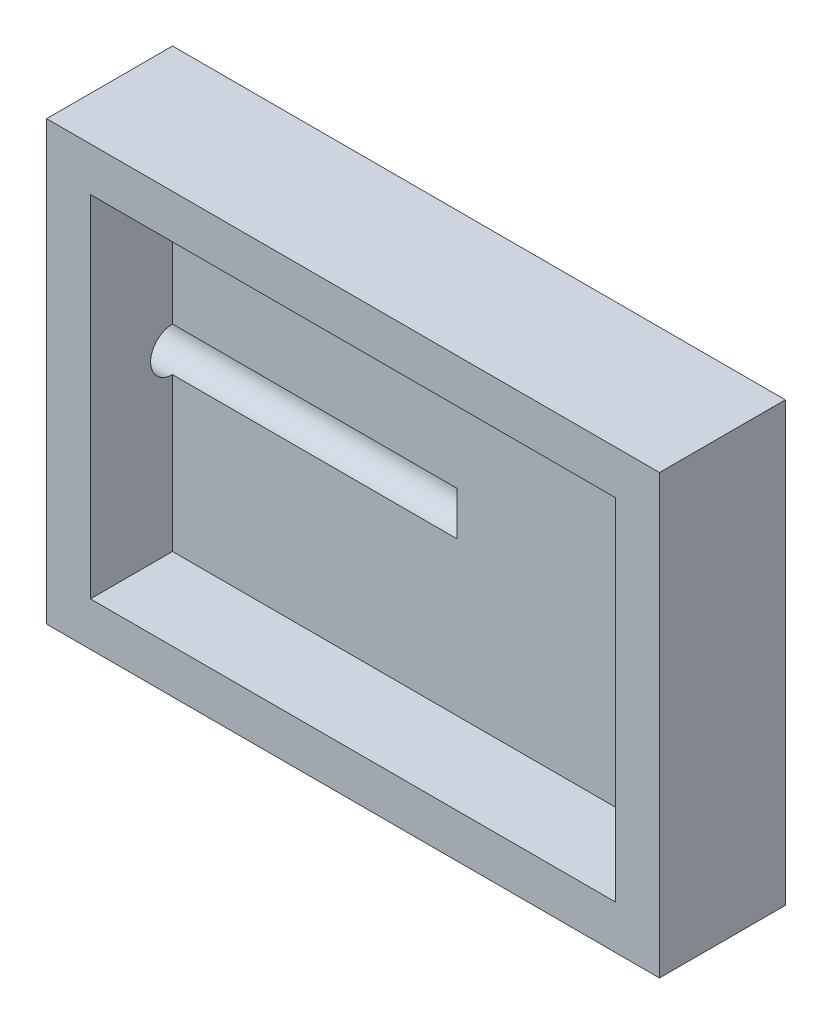
ISO-10303-21;
HEADER;
FILE_DESCRIPTION(('STEP AP214'),'2;1');
FILE_NAME('part.step','',(''),(''),'','','');
FILE_SCHEMA(('AUTOMOTIVE_DESIGN { 1 0 10303 214 1 1 1 1 }'));
ENDSEC;
DATA;
#1=APPLICATION_CONTEXT('core data for automotive mechanical design processes');
#2=APPLICATION_PROTOCOL_DEFINITION('international standard','automotive_design',2000,#1);
#3=PRODUCT_CONTEXT('',#1,'mechanical');
#4=PRODUCT('Part','Part','',(#3));
#5=PRODUCT_RELATED_PRODUCT_CATEGORY('part','',(#4));
#6=PRODUCT_DEFINITION_FORMATION('','',#4);
#7=PRODUCT_DEFINITION_CONTEXT('part definition',#1,'design');
#8=PRODUCT_DEFINITION('design','',#6,#7);
#9=PRODUCT_DEFINITION_SHAPE('','',#8);
#10=(LENGTH_UNIT() NAMED_UNIT(*) SI_UNIT(.MILLI.,.METRE.));
#11=(NAMED_UNIT(*) PLANE_ANGLE_UNIT() SI_UNIT($,.RADIAN.));
#12=(NAMED_UNIT(*) SI_UNIT($,.STERADIAN.) SOLID_ANGLE_UNIT());
#13=UNCERTAINTY_MEASURE_WITH_UNIT(LENGTH_MEASURE(1.E-05),#10,'distance_accuracy_value','');
#14=(GEOMETRIC_REPRESENTATION_CONTEXT(3) GLOBAL_UNCERTAINTY_ASSIGNED_CONTEXT((#13)) GLOBAL_UNIT_ASSIGNED_CONTEXT((#10,
#11,#12)) REPRESENTATION_CONTEXT('',''));
#15=CARTESIAN_POINT('',(0.,0.,0.));
#16=DIRECTION('',(0.,0.,1.));
#17=DIRECTION('',(1.,0.,0.));
#18=AXIS2_PLACEMENT_3D('',#15,#16,#17);
#19=CARTESIAN_POINT('',(0.,0.,36.5125));
#20=DIRECTION('',(0.,0.,-1.));
#21=DIRECTION('',(-1.,0.,0.));
#22=AXIS2_PLACEMENT_3D('',#19,#20,#21);
#23=PLANE('',#22);
#24=DIRECTION('',(0.,1.,0.));
#25=VECTOR('',#24,1.);
#26=CARTESIAN_POINT('',(177.8,-127.,36.5125));
#27=LINE('',#26,#25);
#28=CARTESIAN_POINT('',(177.8,-127.,36.5125));
#29=VERTEX_POINT('',#28);
#30=CARTESIAN_POINT('',(177.8,127.,36.5125));
#31=VERTEX_POINT('',#30);
#32=EDGE_CURVE('E155',#29,#31,#27,.T.);
#33=ORIENTED_EDGE('',*,*,#32,.T.);
#34=DIRECTION('',(-1.,0.,0.));
#35=VECTOR('',#34,1.);
#36=CARTESIAN_POINT('',(-177.8,127.,36.5125));
#37=LINE('',#36,#35);
#38=CARTESIAN_POINT('',(-177.8,127.,36.5125));
#39=VERTEX_POINT('',#38);
#40=EDGE_CURVE('E172',#31,#39,#37,.T.);
#41=ORIENTED_EDGE('',*,*,#40,.T.);
#42=DIRECTION('',(0.,-1.,0.));
#43=VECTOR('',#42,1.);
#44=CARTESIAN_POINT('',(-177.8,-127.,36.5125));
#45=LINE('',#44,#43);
#46=CARTESIAN_POINT('',(-177.8,-127.,36.5125));
#47=VERTEX_POINT('',#46);
#48=EDGE_CURVE('E169',#39,#47,#45,.T.);
#49=ORIENTED_EDGE('',*,*,#48,.T.);
#50=DIRECTION('',(1.,0.,0.));
#51=VECTOR('',#50,1.);
#52=CARTESIAN_POINT('',(-177.8,-127.,36.5125));
#53=LINE('',#52,#51);
#54=EDGE_CURVE('E151',#47,#29,#53,.T.);
#55=ORIENTED_EDGE('',*,*,#54,.T.);
#56=EDGE_LOOP('',(#33,#41,#49,#55));
#57=FACE_BOUND('',#56,.T.);
#58=DIRECTION('',(0.,1.,0.));
#59=VECTOR('',#58,1.);
#60=CARTESIAN_POINT('',(152.4,0.,36.5125));
#61=LINE('',#60,#59);
#62=CARTESIAN_POINT('',(152.4,-101.6,36.5125));
#63=VERTEX_POINT('',#62);
#64=CARTESIAN_POINT('',(152.4,101.6,36.5125));
#65=VERTEX_POINT('',#64);
#66=EDGE_CURVE('E188',#63,#65,#61,.T.);
#67=ORIENTED_EDGE('',*,*,#66,.F.);
#68=DIRECTION('',(1.,0.,0.));
#69=VECTOR('',#68,1.);
#70=CARTESIAN_POINT('',(0.,-101.6,36.5125));
#71=LINE('',#70,#69);
#72=CARTESIAN_POINT('',(-152.4,-101.6,36.5125));
#73=VERTEX_POINT('',#72);
#74=EDGE_CURVE('E178',#73,#63,#71,.T.);
#75=ORIENTED_EDGE('',*,*,#74,.F.);
#76=DIRECTION('',(0.,-1.,0.));
#77=VECTOR('',#76,1.);
#78=CARTESIAN_POINT('',(-152.4,0.,36.5125));
#79=LINE('',#78,#77);
#80=CARTESIAN_POINT('',(-152.4,101.6,36.5125));
#81=VERTEX_POINT('',#80);
#82=EDGE_CURVE('E182',#81,#73,#79,.T.);
#83=ORIENTED_EDGE('',*,*,#82,.F.);
#84=DIRECTION('',(-1.,0.,0.));
#85=VECTOR('',#84,1.);
#86=CARTESIAN_POINT('',(0.,101.6,36.5125));
#87=LINE('',#86,#85);
#88=EDGE_CURVE('E185',#65,#81,#87,.T.);
#89=ORIENTED_EDGE('',*,*,#88,.F.);
#90=EDGE_LOOP('',(#67,#75,#83,#89));
#91=FACE_BOUND('',#90,.T.);
#92=ADVANCED_FACE('F39',(#57,#91),#23,.F.);
#93=CARTESIAN_POINT('',(177.8,-127.,36.5125));
#94=DIRECTION('',(-1.,0.,0.));
#95=DIRECTION('',(0.,0.,1.));
#96=AXIS2_PLACEMENT_3D('',#93,#94,#95);
#97=PLANE('',#96);
#98=DIRECTION('',(0.,1.,0.));
#99=VECTOR('',#98,1.);
#100=CARTESIAN_POINT('',(177.8,-127.,-36.5125));
#101=LINE('',#100,#99);
#102=CARTESIAN_POINT('',(177.8,-127.,-36.5125));
#103=VERTEX_POINT('',#102);
#104=CARTESIAN_POINT('',(177.8,127.,-36.5125));
#105=VERTEX_POINT('',#104);
#106=EDGE_CURVE('E162',#103,#105,#101,.T.);
#107=ORIENTED_EDGE('',*,*,#106,.T.);
#108=DIRECTION('',(0.,0.,-1.));
#109=VECTOR('',#108,1.);
#110=CARTESIAN_POINT('',(177.8,127.,36.5125));
#111=LINE('',#110,#109);
#112=EDGE_CURVE('E121',#31,#105,#111,.T.);
#113=ORIENTED_EDGE('',*,*,#112,.F.);
#114=ORIENTED_EDGE('',*,*,#32,.F.);
#115=DIRECTION('',(0.,0.,-1.));
#116=VECTOR('',#115,1.);
#117=CARTESIAN_POINT('',(177.8,-127.,36.5125));
#118=LINE('',#117,#116);
#119=EDGE_CURVE('E147',#29,#103,#118,.T.);
#120=ORIENTED_EDGE('',*,*,#119,.T.);
#121=EDGE_LOOP('',(#107,#113,#114,#120));
#122=FACE_BOUND('',#121,.T.);
#123=ADVANCED_FACE('F41',(#122),#97,.F.);
#124=CARTESIAN_POINT('',(-177.8,127.,36.5125));
#125=DIRECTION('',(0.,-1.,0.));
#126=DIRECTION('',(0.,0.,-1.));
#127=AXIS2_PLACEMENT_3D('',#124,#125,#126);
#128=PLANE('',#127);
#129=DIRECTION('',(-1.,0.,0.));
#130=VECTOR('',#129,1.);
#131=CARTESIAN_POINT('',(-177.8,127.,-36.5125));
#132=LINE('',#131,#130);
#133=CARTESIAN_POINT('',(-177.8,127.,-36.5125));
#134=VERTEX_POINT('',#133);
#135=EDGE_CURVE('E159',#105,#134,#132,.T.);
#136=ORIENTED_EDGE('',*,*,#135,.T.);
#137=DIRECTION('',(0.,0.,-1.));
#138=VECTOR('',#137,1.);
#139=CARTESIAN_POINT('',(-177.8,127.,36.5125));
#140=LINE('',#139,#138);
#141=EDGE_CURVE('E139',#39,#134,#140,.T.);
#142=ORIENTED_EDGE('',*,*,#141,.F.);
#143=ORIENTED_EDGE('',*,*,#40,.F.);
#144=ORIENTED_EDGE('',*,*,#112,.T.);
#145=EDGE_LOOP('',(#136,#142,#143,#144));
#146=FACE_BOUND('',#145,.T.);
#147=ADVANCED_FACE('F227',(#146),#128,.F.);
#148=CARTESIAN_POINT('',(-177.8,-127.,36.5125));
#149=DIRECTION('',(1.,0.,0.));
#150=DIRECTION('',(0.,0.,-1.));
#151=AXIS2_PLACEMENT_3D('',#148,#149,#150);
#152=PLANE('',#151);
#153=CARTESIAN_POINT('',(-177.8,0.,-11.1125));
#154=DIRECTION('',(-1.,0.,0.));
#155=DIRECTION('',(0.,0.,1.));
#156=AXIS2_PLACEMENT_3D('',#153,#154,#155);
#157=CIRCLE('',#156,12.7);
#158=CARTESIAN_POINT('',(-177.8,0.,1.5875));
#159=VERTEX_POINT('',#158);
#160=EDGE_CURVE('E128',#159,#159,#157,.T.);
#161=ORIENTED_EDGE('',*,*,#160,.F.);
#162=EDGE_LOOP('',(#161));
#163=FACE_BOUND('',#162,.T.);
#164=DIRECTION('',(0.,-1.,0.));
#165=VECTOR('',#164,1.);
#166=CARTESIAN_POINT('',(-177.8,-127.,-36.5125));
#167=LINE('',#166,#165);
#168=CARTESIAN_POINT('',(-177.8,-127.,-36.5125));
#169=VERTEX_POINT('',#168);
#170=EDGE_CURVE('E156',#134,#169,#167,.T.);
#171=ORIENTED_EDGE('',*,*,#170,.T.);
#172=DIRECTION('',(0.,0.,-1.));
#173=VECTOR('',#172,1.);
#174=CARTESIAN_POINT('',(-177.8,-127.,36.5125));
#175=LINE('',#174,#173);
#176=EDGE_CURVE('E143',#47,#169,#175,.T.);
#177=ORIENTED_EDGE('',*,*,#176,.F.);
#178=ORIENTED_EDGE('',*,*,#48,.F.);
#179=ORIENTED_EDGE('',*,*,#141,.T.);
#180=EDGE_LOOP('',(#171,#177,#178,#179));
#181=FACE_BOUND('',#180,.T.);
#182=ADVANCED_FACE('F223',(#163,#181),#152,.F.);
#183=CARTESIAN_POINT('',(-177.8,-127.,36.5125));
#184=DIRECTION('',(0.,1.,0.));
#185=DIRECTION('',(0.,0.,1.));
#186=AXIS2_PLACEMENT_3D('',#183,#184,#185);
#187=PLANE('',#186);
#188=DIRECTION('',(1.,0.,0.));
#189=VECTOR('',#188,1.);
#190=CARTESIAN_POINT('',(-177.8,-127.,-36.5125));
#191=LINE('',#190,#189);
#192=EDGE_CURVE('E152',#169,#103,#191,.T.);
#193=ORIENTED_EDGE('',*,*,#192,.T.);
#194=ORIENTED_EDGE('',*,*,#119,.F.);
#195=ORIENTED_EDGE('',*,*,#54,.F.);
#196=ORIENTED_EDGE('',*,*,#176,.T.);
#197=EDGE_LOOP('',(#193,#194,#195,#196));
#198=FACE_BOUND('',#197,.T.);
#199=ADVANCED_FACE('F226',(#198),#187,.F.);
#200=CARTESIAN_POINT('',(0.,0.,-36.5125));
#201=DIRECTION('',(0.,0.,-1.));
#202=DIRECTION('',(-1.,0.,0.));
#203=AXIS2_PLACEMENT_3D('',#200,#201,#202);
#204=PLANE('',#203);
#205=ORIENTED_EDGE('',*,*,#106,.F.);
#206=ORIENTED_EDGE('',*,*,#192,.F.);
#207=ORIENTED_EDGE('',*,*,#170,.F.);
#208=ORIENTED_EDGE('',*,*,#135,.F.);
#209=EDGE_LOOP('',(#205,#206,#207,#208));
#210=FACE_BOUND('',#209,.T.);
#211=ADVANCED_FACE('F239',(#210),#204,.T.);
#212=CARTESIAN_POINT('',(152.4,-127.,36.5125));
#213=DIRECTION('',(-1.,0.,0.));
#214=DIRECTION('',(0.,0.,1.));
#215=AXIS2_PLACEMENT_3D('',#212,#213,#214);
#216=PLANE('',#215);
#217=DIRECTION('',(0.,1.,0.));
#218=VECTOR('',#217,1.);
#219=CARTESIAN_POINT('',(152.4,0.,-11.1125));
#220=LINE('',#219,#218);
#221=CARTESIAN_POINT('',(152.4,-101.6,-11.1125));
#222=VERTEX_POINT('',#221);
#223=CARTESIAN_POINT('',(152.4,101.6,-11.1125));
#224=VERTEX_POINT('',#223);
#225=EDGE_CURVE('E206',#222,#224,#220,.T.);
#226=ORIENTED_EDGE('',*,*,#225,.F.);
#227=DIRECTION('',(0.,0.,-1.));
#228=VECTOR('',#227,1.);
#229=CARTESIAN_POINT('',(152.4,-101.6,36.5125));
#230=LINE('',#229,#228);
#231=EDGE_CURVE('E181',#63,#222,#230,.T.);
#232=ORIENTED_EDGE('',*,*,#231,.F.);
#233=ORIENTED_EDGE('',*,*,#66,.T.);
#234=DIRECTION('',(0.,0.,-1.));
#235=VECTOR('',#234,1.);
#236=CARTESIAN_POINT('',(152.4,101.6,36.5125));
#237=LINE('',#236,#235);
#238=EDGE_CURVE('E166',#65,#224,#237,.T.);
#239=ORIENTED_EDGE('',*,*,#238,.T.);
#240=EDGE_LOOP('',(#226,#232,#233,#239));
#241=FACE_BOUND('',#240,.T.);
#242=ADVANCED_FACE('F259',(#241),#216,.T.);
#243=CARTESIAN_POINT('',(-177.8,101.6,36.5125));
#244=DIRECTION('',(0.,-1.,0.));
#245=DIRECTION('',(0.,0.,-1.));
#246=AXIS2_PLACEMENT_3D('',#243,#244,#245);
#247=PLANE('',#246);
#248=DIRECTION('',(-1.,0.,0.));
#249=VECTOR('',#248,1.);
#250=CARTESIAN_POINT('',(0.,101.6,-11.1125));
#251=LINE('',#250,#249);
#252=CARTESIAN_POINT('',(-152.4,101.6,-11.1125));
#253=VERTEX_POINT('',#252);
#254=EDGE_CURVE('E203',#224,#253,#251,.T.);
#255=ORIENTED_EDGE('',*,*,#254,.F.);
#256=ORIENTED_EDGE('',*,*,#238,.F.);
#257=ORIENTED_EDGE('',*,*,#88,.T.);
#258=DIRECTION('',(0.,0.,-1.));
#259=VECTOR('',#258,1.);
#260=CARTESIAN_POINT('',(-152.4,101.6,36.5125));
#261=LINE('',#260,#259);
#262=EDGE_CURVE('E196',#81,#253,#261,.T.);
#263=ORIENTED_EDGE('',*,*,#262,.T.);
#264=EDGE_LOOP('',(#255,#256,#257,#263));
#265=FACE_BOUND('',#264,.T.);
#266=ADVANCED_FACE('F275',(#265),#247,.T.);
#267=CARTESIAN_POINT('',(-152.4,-127.,36.5125));
#268=DIRECTION('',(1.,0.,0.));
#269=DIRECTION('',(0.,0.,-1.));
#270=AXIS2_PLACEMENT_3D('',#267,#268,#269);
#271=PLANE('',#270);
#272=CARTESIAN_POINT('',(-152.4,0.,-11.1125));
#273=DIRECTION('',(1.,0.,0.));
#274=DIRECTION('',(0.,0.,-1.));
#275=AXIS2_PLACEMENT_3D('',#272,#273,#274);
#276=CIRCLE('',#275,12.7);
#277=CARTESIAN_POINT('',(-152.4,12.7,-11.1125));
#278=VERTEX_POINT('',#277);
#279=CARTESIAN_POINT('',(-152.4,-12.7,-11.1125));
#280=VERTEX_POINT('',#279);
#281=EDGE_CURVE('E127',#278,#280,#276,.T.);
#282=ORIENTED_EDGE('',*,*,#281,.F.);
#283=DIRECTION('',(0.,-1.,0.));
#284=VECTOR('',#283,1.);
#285=CARTESIAN_POINT('',(-152.4,0.,-11.1125));
#286=LINE('',#285,#284);
#287=EDGE_CURVE('E133',#253,#278,#286,.T.);
#288=ORIENTED_EDGE('',*,*,#287,.F.);
#289=ORIENTED_EDGE('',*,*,#262,.F.);
#290=ORIENTED_EDGE('',*,*,#82,.T.);
#291=DIRECTION('',(0.,0.,-1.));
#292=VECTOR('',#291,1.);
#293=CARTESIAN_POINT('',(-152.4,-101.6,36.5125));
#294=LINE('',#293,#292);
#295=CARTESIAN_POINT('',(-152.4,-101.6,-11.1125));
#296=VERTEX_POINT('',#295);
#297=EDGE_CURVE('E62',#73,#296,#294,.T.);
#298=ORIENTED_EDGE('',*,*,#297,.T.);
#299=EDGE_CURVE('E199',#280,#296,#286,.T.);
#300=ORIENTED_EDGE('',*,*,#299,.F.);
#301=EDGE_LOOP('',(#282,#288,#289,#290,#298,#300));
#302=FACE_BOUND('',#301,.T.);
#303=ADVANCED_FACE('F283',(#302),#271,.T.);
#304=CARTESIAN_POINT('',(-177.8,-101.6,36.5125));
#305=DIRECTION('',(0.,1.,0.));
#306=DIRECTION('',(0.,0.,1.));
#307=AXIS2_PLACEMENT_3D('',#304,#305,#306);
#308=PLANE('',#307);
#309=DIRECTION('',(1.,0.,0.));
#310=VECTOR('',#309,1.);
#311=CARTESIAN_POINT('',(0.,-101.6,-11.1125));
#312=LINE('',#311,#310);
#313=EDGE_CURVE('E191',#296,#222,#312,.T.);
#314=ORIENTED_EDGE('',*,*,#313,.F.);
#315=ORIENTED_EDGE('',*,*,#297,.F.);
#316=ORIENTED_EDGE('',*,*,#74,.T.);
#317=ORIENTED_EDGE('',*,*,#231,.T.);
#318=EDGE_LOOP('',(#314,#315,#316,#317));
#319=FACE_BOUND('',#318,.T.);
#320=ADVANCED_FACE('F292',(#319),#308,.T.);
#321=CARTESIAN_POINT('',(0.,0.,-11.1125));
#322=DIRECTION('',(0.,0.,-1.));
#323=DIRECTION('',(-1.,0.,0.));
#324=AXIS2_PLACEMENT_3D('',#321,#322,#323);
#325=PLANE('',#324);
#326=DIRECTION('',(0.,1.,0.));
#327=VECTOR('',#326,1.);
#328=CARTESIAN_POINT('',(12.7,0.,-11.1125));
#329=LINE('',#328,#327);
#330=CARTESIAN_POINT('',(12.7,-12.7,-11.1125));
#331=VERTEX_POINT('',#330);
#332=CARTESIAN_POINT('',(12.7,12.7,-11.1125));
#333=VERTEX_POINT('',#332);
#334=EDGE_CURVE('E116',#331,#333,#329,.T.);
#335=ORIENTED_EDGE('',*,*,#334,.F.);
#336=DIRECTION('',(-1.,0.,0.));
#337=VECTOR('',#336,1.);
#338=CARTESIAN_POINT('',(12.7,-12.7,-11.1125));
#339=LINE('',#338,#337);
#340=EDGE_CURVE('E11',#331,#280,#339,.T.);
#341=ORIENTED_EDGE('',*,*,#340,.T.);
#342=ORIENTED_EDGE('',*,*,#299,.T.);
#343=ORIENTED_EDGE('',*,*,#313,.T.);
#344=ORIENTED_EDGE('',*,*,#225,.T.);
#345=ORIENTED_EDGE('',*,*,#254,.T.);
#346=ORIENTED_EDGE('',*,*,#287,.T.);
#347=DIRECTION('',(-1.,0.,0.));
#348=VECTOR('',#347,1.);
#349=CARTESIAN_POINT('',(12.7,12.7,-11.1125));
#350=LINE('',#349,#348);
#351=EDGE_CURVE('E48',#278,#333,#350,.F.);
#352=ORIENTED_EDGE('',*,*,#351,.T.);
#353=EDGE_LOOP('',(#335,#341,#342,#343,#344,#345,#346,#352));
#354=FACE_BOUND('',#353,.T.);
#355=ADVANCED_FACE('F131',(#354),#325,.F.);
#356=CARTESIAN_POINT('',(12.7,0.,-11.1125));
#357=DIRECTION('',(-1.,0.,0.));
#358=DIRECTION('',(0.,0.,1.));
#359=AXIS2_PLACEMENT_3D('',#356,#357,#358);
#360=CYLINDRICAL_SURFACE('',#359,12.7);
#361=ORIENTED_EDGE('',*,*,#160,.T.);
#362=EDGE_LOOP('',(#361));
#363=FACE_BOUND('',#362,.T.);
#364=CARTESIAN_POINT('',(12.7,0.,-11.1125));
#365=DIRECTION('',(-1.,0.,0.));
#366=DIRECTION('',(0.,0.,1.));
#367=AXIS2_PLACEMENT_3D('',#364,#365,#366);
#368=CIRCLE('',#367,12.7);
#369=EDGE_CURVE('E54',#333,#331,#368,.T.);
#370=ORIENTED_EDGE('',*,*,#369,.F.);
#371=ORIENTED_EDGE('',*,*,#351,.F.);
#372=ORIENTED_EDGE('',*,*,#281,.T.);
#373=ORIENTED_EDGE('',*,*,#340,.F.);
#374=EDGE_LOOP('',(#370,#371,#372,#373));
#375=FACE_BOUND('',#374,.T.);
#376=ADVANCED_FACE('F124',(#363,#375),#360,.F.);
#377=CARTESIAN_POINT('',(12.7,0.,-11.1125));
#378=DIRECTION('',(-1.,0.,0.));
#379=DIRECTION('',(0.,0.,1.));
#380=AXIS2_PLACEMENT_3D('',#377,#378,#379);
#381=PLANE('',#380);
#382=ORIENTED_EDGE('',*,*,#334,.T.);
#383=ORIENTED_EDGE('',*,*,#369,.T.);
#384=EDGE_LOOP('',(#382,#383));
#385=FACE_BOUND('',#384,.T.);
#386=ADVANCED_FACE('F117',(#385),#381,.T.);
#387=CLOSED_SHELL('',(#92,#123,#147,#182,#199,#211,#242,#266,#303,#320,#355,#376,#386));
#388=MANIFOLD_SOLID_BREP('B2',#387);
#389=ADVANCED_BREP_SHAPE_REPRESENTATION('',(#18,#388),#14);
#390=SHAPE_DEFINITION_REPRESENTATION(#9,#389);
ENDSEC;
END-ISO-10303-21;
